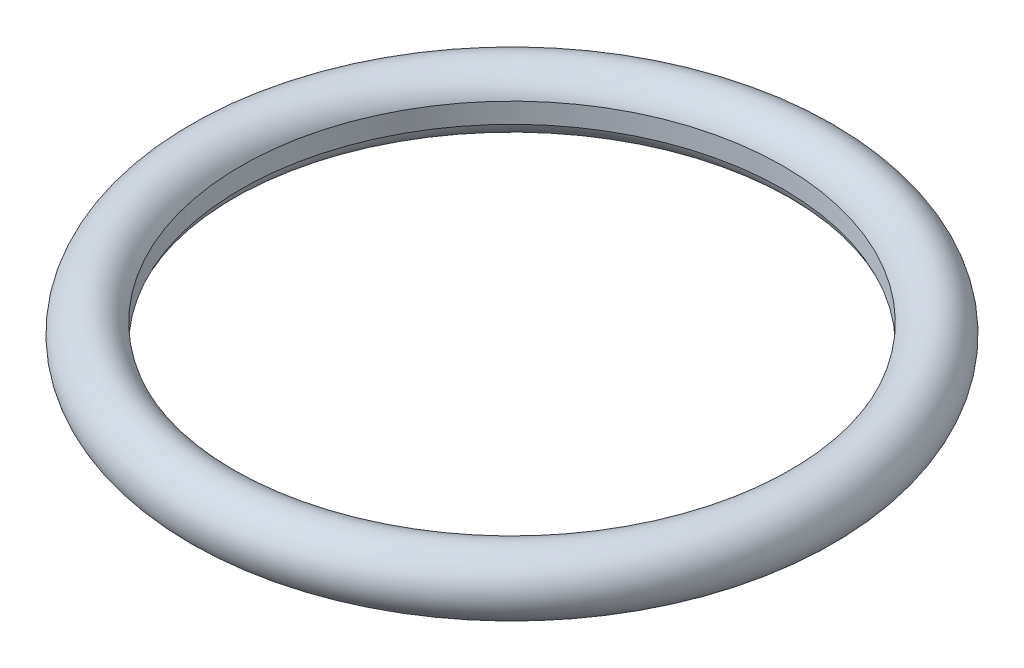
ISO-10303-21;
HEADER;
FILE_DESCRIPTION(('STEP AP214'),'2;1');
FILE_NAME('part.step','',(''),(''),'','','');
FILE_SCHEMA(('AUTOMOTIVE_DESIGN { 1 0 10303 214 1 1 1 1 }'));
ENDSEC;
DATA;
#1=APPLICATION_CONTEXT('core data for automotive mechanical design processes');
#2=APPLICATION_PROTOCOL_DEFINITION('international standard','automotive_design',2000,#1);
#3=PRODUCT_CONTEXT('',#1,'mechanical');
#4=PRODUCT('Part','Part','',(#3));
#5=PRODUCT_RELATED_PRODUCT_CATEGORY('part','',(#4));
#6=PRODUCT_DEFINITION_FORMATION('','',#4);
#7=PRODUCT_DEFINITION_CONTEXT('part definition',#1,'design');
#8=PRODUCT_DEFINITION('design','',#6,#7);
#9=PRODUCT_DEFINITION_SHAPE('','',#8);
#10=(LENGTH_UNIT() NAMED_UNIT(*) SI_UNIT(.MILLI.,.METRE.));
#11=(NAMED_UNIT(*) PLANE_ANGLE_UNIT() SI_UNIT($,.RADIAN.));
#12=(NAMED_UNIT(*) SI_UNIT($,.STERADIAN.) SOLID_ANGLE_UNIT());
#13=UNCERTAINTY_MEASURE_WITH_UNIT(LENGTH_MEASURE(1.E-05),#10,'distance_accuracy_value','');
#14=(GEOMETRIC_REPRESENTATION_CONTEXT(3) GLOBAL_UNCERTAINTY_ASSIGNED_CONTEXT((#13)) GLOBAL_UNIT_ASSIGNED_CONTEXT((#10,
#11,#12)) REPRESENTATION_CONTEXT('',''));
#15=CARTESIAN_POINT('',(0.,0.,0.));
#16=DIRECTION('',(0.,0.,1.));
#17=DIRECTION('',(1.,0.,0.));
#18=AXIS2_PLACEMENT_3D('',#15,#16,#17);
#19=CARTESIAN_POINT('',(0.,0.,0.));
#20=DIRECTION('',(0.,-1.,0.));
#21=DIRECTION('',(0.,0.,-1.));
#22=AXIS2_PLACEMENT_3D('',#19,#20,#21);
#23=TOROIDAL_SURFACE('',#22,14.9142135623731,1.5);
#24=CARTESIAN_POINT('',(0.,-0.5,0.));
#25=DIRECTION('',(0.,-1.,0.));
#26=DIRECTION('',(0.,0.,-1.));
#27=AXIS2_PLACEMENT_3D('',#24,#25,#26);
#28=CIRCLE('',#27,13.5);
#29=CARTESIAN_POINT('',(0.,-0.5,-13.5));
#30=VERTEX_POINT('',#29);
#31=EDGE_CURVE('E10',#30,#30,#28,.T.);
#32=ORIENTED_EDGE('',*,*,#31,.F.);
#33=EDGE_LOOP('',(#32));
#34=FACE_BOUND('',#33,.T.);
#35=CARTESIAN_POINT('',(0.,0.5,0.));
#36=DIRECTION('',(0.,-1.,0.));
#37=DIRECTION('',(0.,0.,-1.));
#38=AXIS2_PLACEMENT_3D('',#35,#36,#37);
#39=CIRCLE('',#38,13.5);
#40=CARTESIAN_POINT('',(0.,0.5,-13.5));
#41=VERTEX_POINT('',#40);
#42=EDGE_CURVE('E36',#41,#41,#39,.T.);
#43=ORIENTED_EDGE('',*,*,#42,.T.);
#44=EDGE_LOOP('',(#43));
#45=FACE_BOUND('',#44,.T.);
#46=ADVANCED_FACE('F30',(#34,#45),#23,.T.);
#47=CARTESIAN_POINT('',(0.,0.,0.));
#48=DIRECTION('',(0.,-1.,0.));
#49=DIRECTION('',(0.,0.,-1.));
#50=AXIS2_PLACEMENT_3D('',#47,#48,#49);
#51=CYLINDRICAL_SURFACE('',#50,13.5);
#52=ORIENTED_EDGE('',*,*,#42,.F.);
#53=EDGE_LOOP('',(#52));
#54=FACE_BOUND('',#53,.T.);
#55=ORIENTED_EDGE('',*,*,#31,.T.);
#56=EDGE_LOOP('',(#55));
#57=FACE_BOUND('',#56,.T.);
#58=ADVANCED_FACE('F43',(#54,#57),#51,.F.);
#59=CLOSED_SHELL('',(#46,#58));
#60=MANIFOLD_SOLID_BREP('B2',#59);
#61=ADVANCED_BREP_SHAPE_REPRESENTATION('',(#18,#60),#14);
#62=SHAPE_DEFINITION_REPRESENTATION(#9,#61);
ENDSEC;
END-ISO-10303-21;
